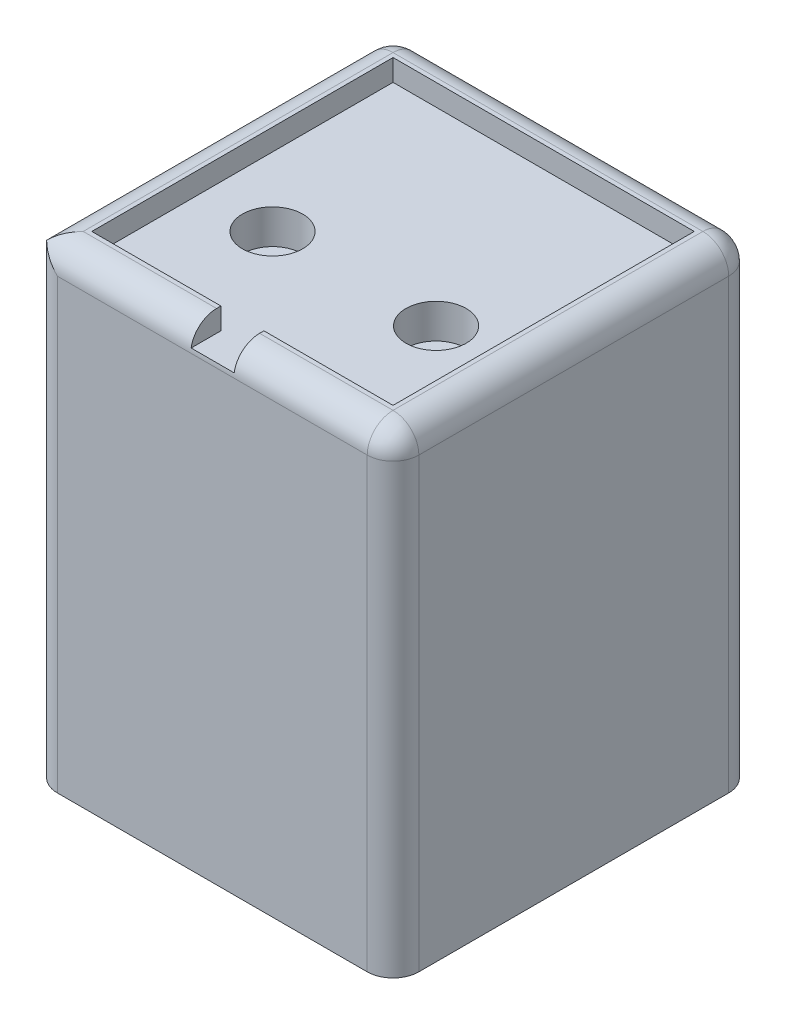
ISO-10303-21;
HEADER;
FILE_DESCRIPTION(('STEP AP214'),'2;1');
FILE_NAME('part.step','',(''),(''),'','','');
FILE_SCHEMA(('AUTOMOTIVE_DESIGN { 1 0 10303 214 1 1 1 1 }'));
ENDSEC;
DATA;
#1=APPLICATION_CONTEXT('core data for automotive mechanical design processes');
#2=APPLICATION_PROTOCOL_DEFINITION('international standard','automotive_design',2000,#1);
#3=PRODUCT_CONTEXT('',#1,'mechanical');
#4=PRODUCT('Part','Part','',(#3));
#5=PRODUCT_RELATED_PRODUCT_CATEGORY('part','',(#4));
#6=PRODUCT_DEFINITION_FORMATION('','',#4);
#7=PRODUCT_DEFINITION_CONTEXT('part definition',#1,'design');
#8=PRODUCT_DEFINITION('design','',#6,#7);
#9=PRODUCT_DEFINITION_SHAPE('','',#8);
#10=(LENGTH_UNIT() NAMED_UNIT(*) SI_UNIT(.MILLI.,.METRE.));
#11=(NAMED_UNIT(*) PLANE_ANGLE_UNIT() SI_UNIT($,.RADIAN.));
#12=(NAMED_UNIT(*) SI_UNIT($,.STERADIAN.) SOLID_ANGLE_UNIT());
#13=UNCERTAINTY_MEASURE_WITH_UNIT(LENGTH_MEASURE(1.E-05),#10,'distance_accuracy_value','');
#14=(GEOMETRIC_REPRESENTATION_CONTEXT(3) GLOBAL_UNCERTAINTY_ASSIGNED_CONTEXT((#13)) GLOBAL_UNIT_ASSIGNED_CONTEXT((#10,
#11,#12)) REPRESENTATION_CONTEXT('',''));
#15=CARTESIAN_POINT('',(0.,0.,0.));
#16=DIRECTION('',(0.,0.,1.));
#17=DIRECTION('',(1.,0.,0.));
#18=AXIS2_PLACEMENT_3D('',#15,#16,#17);
#19=CARTESIAN_POINT('',(17.5,52.5,17.5));
#20=DIRECTION('',(0.,0.,1.));
#21=DIRECTION('',(1.,0.,0.));
#22=AXIS2_PLACEMENT_3D('',#19,#20,#21);
#23=PLANE('',#22);
#24=DIRECTION('',(1.,0.,0.));
#25=VECTOR('',#24,1.);
#26=CARTESIAN_POINT('',(17.5,55.,17.5));
#27=LINE('',#26,#25);
#28=CARTESIAN_POINT('',(-17.5,55.,17.5));
#29=VERTEX_POINT('',#28);
#30=CARTESIAN_POINT('',(-2.5,55.,17.5));
#31=VERTEX_POINT('',#30);
#32=EDGE_CURVE('E195',#29,#31,#27,.T.);
#33=ORIENTED_EDGE('',*,*,#32,.T.);
#34=DIRECTION('',(0.,1.,0.));
#35=VECTOR('',#34,1.);
#36=CARTESIAN_POINT('',(-2.5,52.5,17.5));
#37=LINE('',#36,#35);
#38=CARTESIAN_POINT('',(-2.5,52.5,17.5));
#39=VERTEX_POINT('',#38);
#40=EDGE_CURVE('E177',#39,#31,#37,.T.);
#41=ORIENTED_EDGE('',*,*,#40,.F.);
#42=DIRECTION('',(1.,0.,0.));
#43=VECTOR('',#42,1.);
#44=CARTESIAN_POINT('',(17.5,52.5,17.5));
#45=LINE('',#44,#43);
#46=CARTESIAN_POINT('',(-17.5,52.5,17.5));
#47=VERTEX_POINT('',#46);
#48=EDGE_CURVE('E192',#47,#39,#45,.T.);
#49=ORIENTED_EDGE('',*,*,#48,.F.);
#50=DIRECTION('',(0.,1.,0.));
#51=VECTOR('',#50,1.);
#52=CARTESIAN_POINT('',(-17.5,52.5,17.5));
#53=LINE('',#52,#51);
#54=EDGE_CURVE('E218',#47,#29,#53,.T.);
#55=ORIENTED_EDGE('',*,*,#54,.T.);
#56=EDGE_LOOP('',(#33,#41,#49,#55));
#57=FACE_BOUND('',#56,.T.);
#58=ADVANCED_FACE('F49',(#57),#23,.F.);
#59=CARTESIAN_POINT('',(-21.,55.,-21.));
#60=DIRECTION('',(1.,0.,0.));
#61=DIRECTION('',(0.,0.,-1.));
#62=AXIS2_PLACEMENT_3D('',#59,#60,#61);
#63=PLANE('',#62);
#64=DIRECTION('',(0.,0.,1.));
#65=VECTOR('',#64,1.);
#66=CARTESIAN_POINT('',(-21.,0.,-21.));
#67=LINE('',#66,#65);
#68=CARTESIAN_POINT('',(-21.,0.,-18.));
#69=VERTEX_POINT('',#68);
#70=CARTESIAN_POINT('',(-21.,0.,18.));
#71=VERTEX_POINT('',#70);
#72=EDGE_CURVE('E235',#69,#71,#67,.T.);
#73=ORIENTED_EDGE('',*,*,#72,.T.);
#74=DIRECTION('',(0.,-1.,0.));
#75=VECTOR('',#74,1.);
#76=CARTESIAN_POINT('',(-21.,55.,18.));
#77=LINE('',#76,#75);
#78=CARTESIAN_POINT('',(-21.,52.,18.));
#79=VERTEX_POINT('',#78);
#80=EDGE_CURVE('E321',#71,#79,#77,.F.);
#81=ORIENTED_EDGE('',*,*,#80,.T.);
#82=DIRECTION('',(0.,0.,1.));
#83=VECTOR('',#82,1.);
#84=CARTESIAN_POINT('',(-21.,52.,-21.));
#85=LINE('',#84,#83);
#86=CARTESIAN_POINT('',(-21.,52.,-18.));
#87=VERTEX_POINT('',#86);
#88=EDGE_CURVE('E315',#79,#87,#85,.F.);
#89=ORIENTED_EDGE('',*,*,#88,.T.);
#90=DIRECTION('',(0.,-1.,0.));
#91=VECTOR('',#90,1.);
#92=CARTESIAN_POINT('',(-21.,55.,-18.));
#93=LINE('',#92,#91);
#94=EDGE_CURVE('E318',#87,#69,#93,.T.);
#95=ORIENTED_EDGE('',*,*,#94,.T.);
#96=EDGE_LOOP('',(#73,#81,#89,#95));
#97=FACE_BOUND('',#96,.T.);
#98=ADVANCED_FACE('F459',(#97),#63,.F.);
#99=CARTESIAN_POINT('',(21.,55.,21.));
#100=DIRECTION('',(0.,0.,-1.));
#101=DIRECTION('',(-1.,0.,0.));
#102=AXIS2_PLACEMENT_3D('',#99,#100,#101);
#103=PLANE('',#102);
#104=DIRECTION('',(1.,0.,0.));
#105=VECTOR('',#104,1.);
#106=CARTESIAN_POINT('',(21.,0.,21.));
#107=LINE('',#106,#105);
#108=CARTESIAN_POINT('',(-18.,0.,21.));
#109=VERTEX_POINT('',#108);
#110=CARTESIAN_POINT('',(18.,0.,21.));
#111=VERTEX_POINT('',#110);
#112=EDGE_CURVE('E248',#109,#111,#107,.T.);
#113=ORIENTED_EDGE('',*,*,#112,.T.);
#114=DIRECTION('',(0.,-1.,0.));
#115=VECTOR('',#114,1.);
#116=CARTESIAN_POINT('',(18.,55.,21.));
#117=LINE('',#116,#115);
#118=CARTESIAN_POINT('',(18.,52.,21.));
#119=VERTEX_POINT('',#118);
#120=EDGE_CURVE('E283',#111,#119,#117,.F.);
#121=ORIENTED_EDGE('',*,*,#120,.T.);
#122=DIRECTION('',(1.,0.,0.));
#123=VECTOR('',#122,1.);
#124=CARTESIAN_POINT('',(21.,52.,21.));
#125=LINE('',#124,#123);
#126=CARTESIAN_POINT('',(-18.,52.,21.));
#127=VERTEX_POINT('',#126);
#128=EDGE_CURVE('E279',#119,#127,#125,.F.);
#129=ORIENTED_EDGE('',*,*,#128,.T.);
#130=DIRECTION('',(0.,-1.,0.));
#131=VECTOR('',#130,1.);
#132=CARTESIAN_POINT('',(-18.,55.,21.));
#133=LINE('',#132,#131);
#134=EDGE_CURVE('E276',#127,#109,#133,.T.);
#135=ORIENTED_EDGE('',*,*,#134,.T.);
#136=EDGE_LOOP('',(#113,#121,#129,#135));
#137=FACE_BOUND('',#136,.T.);
#138=ADVANCED_FACE('F457',(#137),#103,.F.);
#139=CARTESIAN_POINT('',(21.,55.,-21.));
#140=DIRECTION('',(-1.,0.,0.));
#141=DIRECTION('',(0.,0.,1.));
#142=AXIS2_PLACEMENT_3D('',#139,#140,#141);
#143=PLANE('',#142);
#144=DIRECTION('',(0.,0.,-1.));
#145=VECTOR('',#144,1.);
#146=CARTESIAN_POINT('',(21.,52.,-21.));
#147=LINE('',#146,#145);
#148=CARTESIAN_POINT('',(21.,52.,-18.));
#149=VERTEX_POINT('',#148);
#150=CARTESIAN_POINT('',(21.,52.,18.));
#151=VERTEX_POINT('',#150);
#152=EDGE_CURVE('E294',#149,#151,#147,.F.);
#153=ORIENTED_EDGE('',*,*,#152,.T.);
#154=DIRECTION('',(0.,-1.,0.));
#155=VECTOR('',#154,1.);
#156=CARTESIAN_POINT('',(21.,55.,18.));
#157=LINE('',#156,#155);
#158=CARTESIAN_POINT('',(21.,0.,18.));
#159=VERTEX_POINT('',#158);
#160=EDGE_CURVE('E300',#151,#159,#157,.T.);
#161=ORIENTED_EDGE('',*,*,#160,.T.);
#162=DIRECTION('',(0.,0.,-1.));
#163=VECTOR('',#162,1.);
#164=CARTESIAN_POINT('',(21.,0.,-21.));
#165=LINE('',#164,#163);
#166=CARTESIAN_POINT('',(21.,0.,-18.));
#167=VERTEX_POINT('',#166);
#168=EDGE_CURVE('E252',#159,#167,#165,.T.);
#169=ORIENTED_EDGE('',*,*,#168,.T.);
#170=DIRECTION('',(0.,-1.,0.));
#171=VECTOR('',#170,1.);
#172=CARTESIAN_POINT('',(21.,55.,-18.));
#173=LINE('',#172,#171);
#174=EDGE_CURVE('E297',#167,#149,#173,.F.);
#175=ORIENTED_EDGE('',*,*,#174,.T.);
#176=EDGE_LOOP('',(#153,#161,#169,#175));
#177=FACE_BOUND('',#176,.T.);
#178=ADVANCED_FACE('F447',(#177),#143,.F.);
#179=CARTESIAN_POINT('',(21.,55.,-21.));
#180=DIRECTION('',(0.,0.,1.));
#181=DIRECTION('',(1.,0.,0.));
#182=AXIS2_PLACEMENT_3D('',#179,#180,#181);
#183=PLANE('',#182);
#184=DIRECTION('',(-1.,0.,0.));
#185=VECTOR('',#184,1.);
#186=CARTESIAN_POINT('',(21.,52.,-21.));
#187=LINE('',#186,#185);
#188=CARTESIAN_POINT('',(-18.,52.,-21.));
#189=VERTEX_POINT('',#188);
#190=CARTESIAN_POINT('',(18.,52.,-21.));
#191=VERTEX_POINT('',#190);
#192=EDGE_CURVE('E67',#189,#191,#187,.F.);
#193=ORIENTED_EDGE('',*,*,#192,.T.);
#194=DIRECTION('',(0.,-1.,0.));
#195=VECTOR('',#194,1.);
#196=CARTESIAN_POINT('',(18.,55.,-21.));
#197=LINE('',#196,#195);
#198=CARTESIAN_POINT('',(18.,0.,-21.));
#199=VERTEX_POINT('',#198);
#200=EDGE_CURVE('E12',#191,#199,#197,.T.);
#201=ORIENTED_EDGE('',*,*,#200,.T.);
#202=DIRECTION('',(-1.,0.,0.));
#203=VECTOR('',#202,1.);
#204=CARTESIAN_POINT('',(21.,0.,-21.));
#205=LINE('',#204,#203);
#206=CARTESIAN_POINT('',(-18.,0.,-21.));
#207=VERTEX_POINT('',#206);
#208=EDGE_CURVE('E256',#199,#207,#205,.T.);
#209=ORIENTED_EDGE('',*,*,#208,.T.);
#210=DIRECTION('',(0.,-1.,0.));
#211=VECTOR('',#210,1.);
#212=CARTESIAN_POINT('',(-18.,55.,-21.));
#213=LINE('',#212,#211);
#214=EDGE_CURVE('E60',#207,#189,#213,.F.);
#215=ORIENTED_EDGE('',*,*,#214,.T.);
#216=EDGE_LOOP('',(#193,#201,#209,#215));
#217=FACE_BOUND('',#216,.T.);
#218=ADVANCED_FACE('F465',(#217),#183,.F.);
#219=CARTESIAN_POINT('',(0.,55.,0.));
#220=DIRECTION('',(0.,-1.,0.));
#221=DIRECTION('',(0.,0.,-1.));
#222=AXIS2_PLACEMENT_3D('',#219,#220,#221);
#223=PLANE('',#222);
#224=DIRECTION('',(0.,0.,-1.));
#225=VECTOR('',#224,1.);
#226=CARTESIAN_POINT('',(2.50000000000001,55.,17.5));
#227=LINE('',#226,#225);
#228=CARTESIAN_POINT('',(2.50000000000001,55.,18.));
#229=VERTEX_POINT('',#228);
#230=CARTESIAN_POINT('',(2.50000000000001,55.,17.5));
#231=VERTEX_POINT('',#230);
#232=EDGE_CURVE('E186',#229,#231,#227,.T.);
#233=ORIENTED_EDGE('',*,*,#232,.F.);
#234=DIRECTION('',(1.,0.,0.));
#235=VECTOR('',#234,1.);
#236=CARTESIAN_POINT('',(0.,55.,18.));
#237=LINE('',#236,#235);
#238=CARTESIAN_POINT('',(18.,55.,18.));
#239=VERTEX_POINT('',#238);
#240=EDGE_CURVE('E272',#229,#239,#237,.T.);
#241=ORIENTED_EDGE('',*,*,#240,.T.);
#242=DIRECTION('',(0.,0.,-1.));
#243=VECTOR('',#242,1.);
#244=CARTESIAN_POINT('',(18.,55.,0.));
#245=LINE('',#244,#243);
#246=CARTESIAN_POINT('',(18.,55.,-18.));
#247=VERTEX_POINT('',#246);
#248=EDGE_CURVE('E260',#239,#247,#245,.T.);
#249=ORIENTED_EDGE('',*,*,#248,.T.);
#250=DIRECTION('',(-1.,0.,0.));
#251=VECTOR('',#250,1.);
#252=CARTESIAN_POINT('',(0.,55.,-18.));
#253=LINE('',#252,#251);
#254=CARTESIAN_POINT('',(-18.,55.,-18.));
#255=VERTEX_POINT('',#254);
#256=EDGE_CURVE('E263',#247,#255,#253,.T.);
#257=ORIENTED_EDGE('',*,*,#256,.T.);
#258=DIRECTION('',(0.,0.,1.));
#259=VECTOR('',#258,1.);
#260=CARTESIAN_POINT('',(-18.,55.,0.));
#261=LINE('',#260,#259);
#262=CARTESIAN_POINT('',(-18.,55.,18.));
#263=VERTEX_POINT('',#262);
#264=EDGE_CURVE('E266',#255,#263,#261,.T.);
#265=ORIENTED_EDGE('',*,*,#264,.T.);
#266=DIRECTION('',(1.,0.,0.));
#267=VECTOR('',#266,1.);
#268=CARTESIAN_POINT('',(-11.75,55.,18.));
#269=LINE('',#268,#267);
#270=CARTESIAN_POINT('',(-2.5,55.,18.));
#271=VERTEX_POINT('',#270);
#272=EDGE_CURVE('E269',#263,#271,#269,.T.);
#273=ORIENTED_EDGE('',*,*,#272,.T.);
#274=DIRECTION('',(0.,0.,1.));
#275=VECTOR('',#274,1.);
#276=CARTESIAN_POINT('',(-2.5,55.,17.5));
#277=LINE('',#276,#275);
#278=EDGE_CURVE('E374',#31,#271,#277,.T.);
#279=ORIENTED_EDGE('',*,*,#278,.F.);
#280=ORIENTED_EDGE('',*,*,#32,.F.);
#281=DIRECTION('',(0.,0.,1.));
#282=VECTOR('',#281,1.);
#283=CARTESIAN_POINT('',(-17.5,55.,-17.5));
#284=LINE('',#283,#282);
#285=CARTESIAN_POINT('',(-17.5,55.,-17.5));
#286=VERTEX_POINT('',#285);
#287=EDGE_CURVE('E197',#286,#29,#284,.T.);
#288=ORIENTED_EDGE('',*,*,#287,.F.);
#289=DIRECTION('',(-1.,0.,0.));
#290=VECTOR('',#289,1.);
#291=CARTESIAN_POINT('',(17.5,55.,-17.5));
#292=LINE('',#291,#290);
#293=CARTESIAN_POINT('',(17.5,55.,-17.5));
#294=VERTEX_POINT('',#293);
#295=EDGE_CURVE('E228',#294,#286,#292,.T.);
#296=ORIENTED_EDGE('',*,*,#295,.F.);
#297=DIRECTION('',(0.,0.,-1.));
#298=VECTOR('',#297,1.);
#299=CARTESIAN_POINT('',(17.5,55.,-17.5));
#300=LINE('',#299,#298);
#301=CARTESIAN_POINT('',(17.5,55.,17.5));
#302=VERTEX_POINT('',#301);
#303=EDGE_CURVE('E224',#302,#294,#300,.T.);
#304=ORIENTED_EDGE('',*,*,#303,.F.);
#305=EDGE_CURVE('E221',#231,#302,#27,.T.);
#306=ORIENTED_EDGE('',*,*,#305,.F.);
#307=EDGE_LOOP('',(#233,#241,#249,#257,#265,#273,#279,#280,#288,#296,#304,#306));
#308=FACE_BOUND('',#307,.T.);
#309=ADVANCED_FACE('F409',(#308),#223,.F.);
#310=CARTESIAN_POINT('',(0.,0.,0.));
#311=DIRECTION('',(0.,-1.,0.));
#312=DIRECTION('',(0.,0.,-1.));
#313=AXIS2_PLACEMENT_3D('',#310,#311,#312);
#314=PLANE('',#313);
#315=ORIENTED_EDGE('',*,*,#168,.F.);
#316=CARTESIAN_POINT('',(18.,0.,18.));
#317=DIRECTION('',(0.,-1.,0.));
#318=DIRECTION('',(0.,0.,-1.));
#319=AXIS2_PLACEMENT_3D('',#316,#317,#318);
#320=CIRCLE('',#319,3.);
#321=EDGE_CURVE('E312',#159,#111,#320,.T.);
#322=ORIENTED_EDGE('',*,*,#321,.T.);
#323=ORIENTED_EDGE('',*,*,#112,.F.);
#324=CARTESIAN_POINT('',(-18.,0.,18.));
#325=DIRECTION('',(0.,-1.,0.));
#326=DIRECTION('',(0.,0.,-1.));
#327=AXIS2_PLACEMENT_3D('',#324,#325,#326);
#328=CIRCLE('',#327,3.);
#329=EDGE_CURVE('E309',#109,#71,#328,.T.);
#330=ORIENTED_EDGE('',*,*,#329,.T.);
#331=ORIENTED_EDGE('',*,*,#72,.F.);
#332=CARTESIAN_POINT('',(-18.,0.,-18.));
#333=DIRECTION('',(0.,-1.,0.));
#334=DIRECTION('',(0.,0.,-1.));
#335=AXIS2_PLACEMENT_3D('',#332,#333,#334);
#336=CIRCLE('',#335,3.);
#337=EDGE_CURVE('E303',#69,#207,#336,.T.);
#338=ORIENTED_EDGE('',*,*,#337,.T.);
#339=ORIENTED_EDGE('',*,*,#208,.F.);
#340=CARTESIAN_POINT('',(18.,0.,-18.));
#341=DIRECTION('',(0.,-1.,0.));
#342=DIRECTION('',(0.,0.,-1.));
#343=AXIS2_PLACEMENT_3D('',#340,#341,#342);
#344=CIRCLE('',#343,3.);
#345=EDGE_CURVE('E306',#199,#167,#344,.T.);
#346=ORIENTED_EDGE('',*,*,#345,.T.);
#347=EDGE_LOOP('',(#315,#322,#323,#330,#331,#338,#339,#346));
#348=FACE_BOUND('',#347,.T.);
#349=ADVANCED_FACE('F456',(#348),#314,.T.);
#350=CARTESIAN_POINT('',(-17.5,52.5,-17.5));
#351=DIRECTION('',(-1.,0.,0.));
#352=DIRECTION('',(0.,0.,1.));
#353=AXIS2_PLACEMENT_3D('',#350,#351,#352);
#354=PLANE('',#353);
#355=ORIENTED_EDGE('',*,*,#287,.T.);
#356=ORIENTED_EDGE('',*,*,#54,.F.);
#357=DIRECTION('',(0.,0.,1.));
#358=VECTOR('',#357,1.);
#359=CARTESIAN_POINT('',(-17.5,52.5,-17.5));
#360=LINE('',#359,#358);
#361=CARTESIAN_POINT('',(-17.5,52.5,-17.5));
#362=VERTEX_POINT('',#361);
#363=EDGE_CURVE('E203',#362,#47,#360,.T.);
#364=ORIENTED_EDGE('',*,*,#363,.F.);
#365=DIRECTION('',(0.,1.,0.));
#366=VECTOR('',#365,1.);
#367=CARTESIAN_POINT('',(-17.5,52.5,-17.5));
#368=LINE('',#367,#366);
#369=EDGE_CURVE('E232',#362,#286,#368,.T.);
#370=ORIENTED_EDGE('',*,*,#369,.T.);
#371=EDGE_LOOP('',(#355,#356,#364,#370));
#372=FACE_BOUND('',#371,.T.);
#373=ADVANCED_FACE('F405',(#372),#354,.F.);
#374=CARTESIAN_POINT('',(17.5,52.5,-17.5));
#375=DIRECTION('',(0.,0.,-1.));
#376=DIRECTION('',(-1.,0.,0.));
#377=AXIS2_PLACEMENT_3D('',#374,#375,#376);
#378=PLANE('',#377);
#379=ORIENTED_EDGE('',*,*,#295,.T.);
#380=ORIENTED_EDGE('',*,*,#369,.F.);
#381=DIRECTION('',(-1.,0.,0.));
#382=VECTOR('',#381,1.);
#383=CARTESIAN_POINT('',(17.5,52.5,-17.5));
#384=LINE('',#383,#382);
#385=CARTESIAN_POINT('',(17.5,52.5,-17.5));
#386=VERTEX_POINT('',#385);
#387=EDGE_CURVE('E211',#386,#362,#384,.T.);
#388=ORIENTED_EDGE('',*,*,#387,.F.);
#389=DIRECTION('',(0.,1.,0.));
#390=VECTOR('',#389,1.);
#391=CARTESIAN_POINT('',(17.5,52.5,-17.5));
#392=LINE('',#391,#390);
#393=EDGE_CURVE('E236',#386,#294,#392,.T.);
#394=ORIENTED_EDGE('',*,*,#393,.T.);
#395=EDGE_LOOP('',(#379,#380,#388,#394));
#396=FACE_BOUND('',#395,.T.);
#397=ADVANCED_FACE('F401',(#396),#378,.F.);
#398=CARTESIAN_POINT('',(17.5,52.5,-17.5));
#399=DIRECTION('',(1.,0.,0.));
#400=DIRECTION('',(0.,0.,-1.));
#401=AXIS2_PLACEMENT_3D('',#398,#399,#400);
#402=PLANE('',#401);
#403=ORIENTED_EDGE('',*,*,#303,.T.);
#404=ORIENTED_EDGE('',*,*,#393,.F.);
#405=DIRECTION('',(0.,0.,-1.));
#406=VECTOR('',#405,1.);
#407=CARTESIAN_POINT('',(17.5,52.5,-17.5));
#408=LINE('',#407,#406);
#409=CARTESIAN_POINT('',(17.5,52.5,17.5));
#410=VERTEX_POINT('',#409);
#411=EDGE_CURVE('E205',#410,#386,#408,.T.);
#412=ORIENTED_EDGE('',*,*,#411,.F.);
#413=DIRECTION('',(0.,1.,0.));
#414=VECTOR('',#413,1.);
#415=CARTESIAN_POINT('',(17.5,52.5,17.5));
#416=LINE('',#415,#414);
#417=EDGE_CURVE('E239',#410,#302,#416,.T.);
#418=ORIENTED_EDGE('',*,*,#417,.T.);
#419=EDGE_LOOP('',(#403,#404,#412,#418));
#420=FACE_BOUND('',#419,.T.);
#421=ADVANCED_FACE('F398',(#420),#402,.F.);
#422=CARTESIAN_POINT('',(2.50000000000001,52.5,17.5));
#423=VERTEX_POINT('',#422);
#424=EDGE_CURVE('E206',#423,#410,#45,.T.);
#425=ORIENTED_EDGE('',*,*,#424,.F.);
#426=DIRECTION('',(0.,1.,0.));
#427=VECTOR('',#426,1.);
#428=CARTESIAN_POINT('',(2.50000000000001,52.5,17.5));
#429=LINE('',#428,#427);
#430=EDGE_CURVE('E198',#423,#231,#429,.T.);
#431=ORIENTED_EDGE('',*,*,#430,.T.);
#432=ORIENTED_EDGE('',*,*,#305,.T.);
#433=ORIENTED_EDGE('',*,*,#417,.F.);
#434=EDGE_LOOP('',(#425,#431,#432,#433));
#435=FACE_BOUND('',#434,.T.);
#436=ADVANCED_FACE('F394',(#435),#23,.F.);
#437=CARTESIAN_POINT('',(0.,52.5,0.));
#438=DIRECTION('',(0.,-1.,0.));
#439=DIRECTION('',(0.,0.,-1.));
#440=AXIS2_PLACEMENT_3D('',#437,#438,#439);
#441=PLANE('',#440);
#442=CARTESIAN_POINT('',(-9.5,52.5,4.5));
#443=DIRECTION('',(0.,1.,0.));
#444=DIRECTION('',(0.,0.,1.));
#445=AXIS2_PLACEMENT_3D('',#442,#443,#444);
#446=CIRCLE('',#445,3.5);
#447=CARTESIAN_POINT('',(-9.5,52.5,8.));
#448=VERTEX_POINT('',#447);
#449=EDGE_CURVE('E511',#448,#448,#446,.T.);
#450=ORIENTED_EDGE('',*,*,#449,.F.);
#451=EDGE_LOOP('',(#450));
#452=FACE_BOUND('',#451,.T.);
#453=CARTESIAN_POINT('',(9.50000000000001,52.5,4.5));
#454=DIRECTION('',(0.,1.,0.));
#455=DIRECTION('',(0.,0.,-1.));
#456=AXIS2_PLACEMENT_3D('',#453,#454,#455);
#457=CIRCLE('',#456,3.5);
#458=CARTESIAN_POINT('',(9.50000000000001,52.5,1.));
#459=VERTEX_POINT('',#458);
#460=EDGE_CURVE('E515',#459,#459,#457,.T.);
#461=ORIENTED_EDGE('',*,*,#460,.F.);
#462=EDGE_LOOP('',(#461));
#463=FACE_BOUND('',#462,.T.);
#464=DIRECTION('',(0.,0.,1.));
#465=VECTOR('',#464,1.);
#466=CARTESIAN_POINT('',(-2.5,52.5,17.5));
#467=LINE('',#466,#465);
#468=CARTESIAN_POINT('',(-2.49999999999999,52.5,20.9580398915498));
#469=VERTEX_POINT('',#468);
#470=EDGE_CURVE('E173',#39,#469,#467,.T.);
#471=ORIENTED_EDGE('',*,*,#470,.T.);
#472=DIRECTION('',(1.,0.,0.));
#473=VECTOR('',#472,1.);
#474=CARTESIAN_POINT('',(-2.49999999999999,52.5,20.9580398915498));
#475=LINE('',#474,#473);
#476=CARTESIAN_POINT('',(2.50000000000001,52.5,20.9580398915498));
#477=VERTEX_POINT('',#476);
#478=EDGE_CURVE('E288',#469,#477,#475,.T.);
#479=ORIENTED_EDGE('',*,*,#478,.T.);
#480=DIRECTION('',(0.,0.,-1.));
#481=VECTOR('',#480,1.);
#482=CARTESIAN_POINT('',(2.50000000000001,52.5,17.5));
#483=LINE('',#482,#481);
#484=EDGE_CURVE('E185',#477,#423,#483,.T.);
#485=ORIENTED_EDGE('',*,*,#484,.T.);
#486=ORIENTED_EDGE('',*,*,#424,.T.);
#487=ORIENTED_EDGE('',*,*,#411,.T.);
#488=ORIENTED_EDGE('',*,*,#387,.T.);
#489=ORIENTED_EDGE('',*,*,#363,.T.);
#490=ORIENTED_EDGE('',*,*,#48,.T.);
#491=EDGE_LOOP('',(#471,#479,#485,#486,#487,#488,#489,#490));
#492=FACE_BOUND('',#491,.T.);
#493=ADVANCED_FACE('F200',(#452,#463,#492),#441,.F.);
#494=CARTESIAN_POINT('',(-2.5,52.5,17.5));
#495=DIRECTION('',(-1.,0.,0.));
#496=DIRECTION('',(0.,0.,1.));
#497=AXIS2_PLACEMENT_3D('',#494,#495,#496);
#498=PLANE('',#497);
#499=ORIENTED_EDGE('',*,*,#278,.T.);
#500=CARTESIAN_POINT('',(-2.5,52.,18.));
#501=DIRECTION('',(-1.,0.,0.));
#502=DIRECTION('',(0.,0.,1.));
#503=AXIS2_PLACEMENT_3D('',#500,#501,#502);
#504=CIRCLE('',#503,3.);
#505=EDGE_CURVE('E180',#271,#469,#504,.F.);
#506=ORIENTED_EDGE('',*,*,#505,.T.);
#507=ORIENTED_EDGE('',*,*,#470,.F.);
#508=ORIENTED_EDGE('',*,*,#40,.T.);
#509=EDGE_LOOP('',(#499,#506,#507,#508));
#510=FACE_BOUND('',#509,.T.);
#511=ADVANCED_FACE('F176',(#510),#498,.F.);
#512=CARTESIAN_POINT('',(2.50000000000001,52.5,17.5));
#513=DIRECTION('',(1.,0.,0.));
#514=DIRECTION('',(0.,0.,-1.));
#515=AXIS2_PLACEMENT_3D('',#512,#513,#514);
#516=PLANE('',#515);
#517=ORIENTED_EDGE('',*,*,#484,.F.);
#518=CARTESIAN_POINT('',(2.50000000000001,52.,18.));
#519=DIRECTION('',(1.,0.,0.));
#520=DIRECTION('',(0.,0.,-1.));
#521=AXIS2_PLACEMENT_3D('',#518,#519,#520);
#522=CIRCLE('',#521,3.);
#523=EDGE_CURVE('E291',#477,#229,#522,.F.);
#524=ORIENTED_EDGE('',*,*,#523,.T.);
#525=ORIENTED_EDGE('',*,*,#232,.T.);
#526=ORIENTED_EDGE('',*,*,#430,.F.);
#527=EDGE_LOOP('',(#517,#524,#525,#526));
#528=FACE_BOUND('',#527,.T.);
#529=ADVANCED_FACE('F392',(#528),#516,.F.);
#530=CARTESIAN_POINT('',(18.,55.,-18.));
#531=DIRECTION('',(0.,-1.,0.));
#532=DIRECTION('',(0.,0.,-1.));
#533=AXIS2_PLACEMENT_3D('',#530,#531,#532);
#534=CYLINDRICAL_SURFACE('',#533,3.);
#535=ORIENTED_EDGE('',*,*,#345,.F.);
#536=ORIENTED_EDGE('',*,*,#200,.F.);
#537=CARTESIAN_POINT('',(18.,52.,-18.));
#538=DIRECTION('',(0.,1.,0.));
#539=DIRECTION('',(0.,0.,1.));
#540=AXIS2_PLACEMENT_3D('',#537,#538,#539);
#541=CIRCLE('',#540,3.);
#542=EDGE_CURVE('E366',#149,#191,#541,.T.);
#543=ORIENTED_EDGE('',*,*,#542,.F.);
#544=ORIENTED_EDGE('',*,*,#174,.F.);
#545=EDGE_LOOP('',(#535,#536,#543,#544));
#546=FACE_BOUND('',#545,.T.);
#547=ADVANCED_FACE('F51',(#546),#534,.T.);
#548=CARTESIAN_POINT('',(-18.,55.,-18.));
#549=DIRECTION('',(0.,-1.,0.));
#550=DIRECTION('',(0.,0.,-1.));
#551=AXIS2_PLACEMENT_3D('',#548,#549,#550);
#552=CYLINDRICAL_SURFACE('',#551,3.);
#553=ORIENTED_EDGE('',*,*,#337,.F.);
#554=ORIENTED_EDGE('',*,*,#94,.F.);
#555=CARTESIAN_POINT('',(-18.,52.,-18.));
#556=DIRECTION('',(0.,1.,0.));
#557=DIRECTION('',(0.,0.,1.));
#558=AXIS2_PLACEMENT_3D('',#555,#556,#557);
#559=CIRCLE('',#558,3.);
#560=EDGE_CURVE('E363',#189,#87,#559,.T.);
#561=ORIENTED_EDGE('',*,*,#560,.F.);
#562=ORIENTED_EDGE('',*,*,#214,.F.);
#563=EDGE_LOOP('',(#553,#554,#561,#562));
#564=FACE_BOUND('',#563,.T.);
#565=ADVANCED_FACE('F616',(#564),#552,.T.);
#566=CARTESIAN_POINT('',(0.,52.,-18.));
#567=DIRECTION('',(-1.,0.,0.));
#568=DIRECTION('',(0.,0.,1.));
#569=AXIS2_PLACEMENT_3D('',#566,#567,#568);
#570=CYLINDRICAL_SURFACE('',#569,3.);
#571=CARTESIAN_POINT('',(18.,52.,-18.));
#572=DIRECTION('',(1.,0.,0.));
#573=DIRECTION('',(0.,0.,-1.));
#574=AXIS2_PLACEMENT_3D('',#571,#572,#573);
#575=CIRCLE('',#574,3.);
#576=EDGE_CURVE('E53',#191,#247,#575,.T.);
#577=ORIENTED_EDGE('',*,*,#576,.F.);
#578=ORIENTED_EDGE('',*,*,#192,.F.);
#579=CARTESIAN_POINT('',(-18.,52.,-18.));
#580=DIRECTION('',(-1.,0.,0.));
#581=DIRECTION('',(0.,0.,1.));
#582=AXIS2_PLACEMENT_3D('',#579,#580,#581);
#583=CIRCLE('',#582,3.);
#584=EDGE_CURVE('E359',#255,#189,#583,.T.);
#585=ORIENTED_EDGE('',*,*,#584,.F.);
#586=ORIENTED_EDGE('',*,*,#256,.F.);
#587=EDGE_LOOP('',(#577,#578,#585,#586));
#588=FACE_BOUND('',#587,.T.);
#589=ADVANCED_FACE('F422',(#588),#570,.T.);
#590=CARTESIAN_POINT('',(18.,52.,-18.));
#591=DIRECTION('',(0.,0.,-1.));
#592=DIRECTION('',(-1.,0.,0.));
#593=AXIS2_PLACEMENT_3D('',#590,#591,#592);
#594=SPHERICAL_SURFACE('',#593,3.);
#595=ORIENTED_EDGE('',*,*,#542,.T.);
#596=ORIENTED_EDGE('',*,*,#576,.T.);
#597=CARTESIAN_POINT('',(18.,52.,-18.));
#598=DIRECTION('',(0.,0.,-1.));
#599=DIRECTION('',(-1.,0.,0.));
#600=AXIS2_PLACEMENT_3D('',#597,#598,#599);
#601=CIRCLE('',#600,3.);
#602=EDGE_CURVE('E355',#149,#247,#601,.F.);
#603=ORIENTED_EDGE('',*,*,#602,.F.);
#604=EDGE_LOOP('',(#595,#596,#603));
#605=FACE_BOUND('',#604,.T.);
#606=ADVANCED_FACE('F601',(#605),#594,.T.);
#607=CARTESIAN_POINT('',(-18.,52.,-18.));
#608=DIRECTION('',(0.,0.,-1.));
#609=DIRECTION('',(-1.,0.,0.));
#610=AXIS2_PLACEMENT_3D('',#607,#608,#609);
#611=SPHERICAL_SURFACE('',#610,3.);
#612=ORIENTED_EDGE('',*,*,#584,.T.);
#613=ORIENTED_EDGE('',*,*,#560,.T.);
#614=CARTESIAN_POINT('',(-18.,52.,-18.));
#615=DIRECTION('',(0.,0.,-1.));
#616=DIRECTION('',(-1.,0.,0.));
#617=AXIS2_PLACEMENT_3D('',#614,#615,#616);
#618=CIRCLE('',#617,3.);
#619=EDGE_CURVE('E347',#255,#87,#618,.F.);
#620=ORIENTED_EDGE('',*,*,#619,.F.);
#621=EDGE_LOOP('',(#612,#613,#620));
#622=FACE_BOUND('',#621,.T.);
#623=ADVANCED_FACE('F426',(#622),#611,.T.);
#624=CARTESIAN_POINT('',(18.,52.,0.));
#625=DIRECTION('',(0.,0.,-1.));
#626=DIRECTION('',(-1.,0.,0.));
#627=AXIS2_PLACEMENT_3D('',#624,#625,#626);
#628=CYLINDRICAL_SURFACE('',#627,3.);
#629=ORIENTED_EDGE('',*,*,#602,.T.);
#630=ORIENTED_EDGE('',*,*,#248,.F.);
#631=CARTESIAN_POINT('',(18.,52.,18.));
#632=DIRECTION('',(0.,0.,1.));
#633=DIRECTION('',(0.,-1.,0.));
#634=AXIS2_PLACEMENT_3D('',#631,#632,#633);
#635=CIRCLE('',#634,3.);
#636=EDGE_CURVE('E343',#151,#239,#635,.T.);
#637=ORIENTED_EDGE('',*,*,#636,.F.);
#638=ORIENTED_EDGE('',*,*,#152,.F.);
#639=EDGE_LOOP('',(#629,#630,#637,#638));
#640=FACE_BOUND('',#639,.T.);
#641=ADVANCED_FACE('F444',(#640),#628,.T.);
#642=CARTESIAN_POINT('',(18.,55.,18.));
#643=DIRECTION('',(0.,-1.,0.));
#644=DIRECTION('',(0.,0.,-1.));
#645=AXIS2_PLACEMENT_3D('',#642,#643,#644);
#646=CYLINDRICAL_SURFACE('',#645,3.);
#647=ORIENTED_EDGE('',*,*,#321,.F.);
#648=ORIENTED_EDGE('',*,*,#160,.F.);
#649=CARTESIAN_POINT('',(18.,52.,18.));
#650=DIRECTION('',(0.,1.,0.));
#651=DIRECTION('',(0.,0.,1.));
#652=AXIS2_PLACEMENT_3D('',#649,#650,#651);
#653=CIRCLE('',#652,3.);
#654=EDGE_CURVE('E339',#119,#151,#653,.T.);
#655=ORIENTED_EDGE('',*,*,#654,.F.);
#656=ORIENTED_EDGE('',*,*,#120,.F.);
#657=EDGE_LOOP('',(#647,#648,#655,#656));
#658=FACE_BOUND('',#657,.T.);
#659=ADVANCED_FACE('F452',(#658),#646,.T.);
#660=CARTESIAN_POINT('',(-18.,55.,18.));
#661=DIRECTION('',(0.,-1.,0.));
#662=DIRECTION('',(0.,0.,-1.));
#663=AXIS2_PLACEMENT_3D('',#660,#661,#662);
#664=CYLINDRICAL_SURFACE('',#663,3.);
#665=CARTESIAN_POINT('',(-18.,52.,18.));
#666=DIRECTION('',(0.,-0.707106781186547,0.707106781186547));
#667=DIRECTION('',(0.,0.707106781186547,0.707106781186547));
#668=AXIS2_PLACEMENT_3D('',#665,#666,#667);
#669=ELLIPSE('',#668,4.24264068711928,3.);
#670=CARTESIAN_POINT('',(-20.1213203435596,54.1213203435596,20.1213203435596));
#671=VERTEX_POINT('',#670);
#672=EDGE_CURVE('E351',#79,#671,#669,.F.);
#673=ORIENTED_EDGE('',*,*,#672,.F.);
#674=ORIENTED_EDGE('',*,*,#80,.F.);
#675=ORIENTED_EDGE('',*,*,#329,.F.);
#676=ORIENTED_EDGE('',*,*,#134,.F.);
#677=CARTESIAN_POINT('',(-18.,52.,18.));
#678=DIRECTION('',(0.707106781186547,0.707106781186547,0.));
#679=DIRECTION('',(0.707106781186547,-0.707106781186547,0.));
#680=AXIS2_PLACEMENT_3D('',#677,#678,#679);
#681=ELLIPSE('',#680,4.24264068711928,3.);
#682=EDGE_CURVE('E336',#671,#127,#681,.T.);
#683=ORIENTED_EDGE('',*,*,#682,.F.);
#684=EDGE_LOOP('',(#673,#674,#675,#676,#683));
#685=FACE_BOUND('',#684,.T.);
#686=ADVANCED_FACE('F435',(#685),#664,.T.);
#687=CARTESIAN_POINT('',(-18.,52.,0.));
#688=DIRECTION('',(0.,0.,1.));
#689=DIRECTION('',(1.,0.,0.));
#690=AXIS2_PLACEMENT_3D('',#687,#688,#689);
#691=CYLINDRICAL_SURFACE('',#690,3.);
#692=ORIENTED_EDGE('',*,*,#88,.F.);
#693=ORIENTED_EDGE('',*,*,#672,.T.);
#694=CARTESIAN_POINT('',(-18.,52.,18.));
#695=DIRECTION('',(0.707106781186548,0.,0.707106781186547));
#696=DIRECTION('',(0.707106781186547,0.,-0.707106781186548));
#697=AXIS2_PLACEMENT_3D('',#694,#695,#696);
#698=ELLIPSE('',#697,4.24264068711929,3.);
#699=EDGE_CURVE('E331',#263,#671,#698,.T.);
#700=ORIENTED_EDGE('',*,*,#699,.F.);
#701=ORIENTED_EDGE('',*,*,#264,.F.);
#702=ORIENTED_EDGE('',*,*,#619,.T.);
#703=EDGE_LOOP('',(#692,#693,#700,#701,#702));
#704=FACE_BOUND('',#703,.T.);
#705=ADVANCED_FACE('F429',(#704),#691,.T.);
#706=CARTESIAN_POINT('',(18.,52.,18.));
#707=DIRECTION('',(1.,0.,0.));
#708=DIRECTION('',(0.,0.,-1.));
#709=AXIS2_PLACEMENT_3D('',#706,#707,#708);
#710=SPHERICAL_SURFACE('',#709,3.);
#711=ORIENTED_EDGE('',*,*,#654,.T.);
#712=ORIENTED_EDGE('',*,*,#636,.T.);
#713=CARTESIAN_POINT('',(18.,52.,18.));
#714=DIRECTION('',(1.,0.,0.));
#715=DIRECTION('',(0.,0.,-1.));
#716=AXIS2_PLACEMENT_3D('',#713,#714,#715);
#717=CIRCLE('',#716,3.);
#718=EDGE_CURVE('E328',#119,#239,#717,.F.);
#719=ORIENTED_EDGE('',*,*,#718,.F.);
#720=EDGE_LOOP('',(#711,#712,#719));
#721=FACE_BOUND('',#720,.T.);
#722=ADVANCED_FACE('F441',(#721),#710,.T.);
#723=CARTESIAN_POINT('',(0.,52.,18.));
#724=DIRECTION('',(1.,0.,0.));
#725=DIRECTION('',(0.,0.,-1.));
#726=AXIS2_PLACEMENT_3D('',#723,#724,#725);
#727=CYLINDRICAL_SURFACE('',#726,3.);
#728=ORIENTED_EDGE('',*,*,#682,.T.);
#729=ORIENTED_EDGE('',*,*,#128,.F.);
#730=ORIENTED_EDGE('',*,*,#718,.T.);
#731=ORIENTED_EDGE('',*,*,#240,.F.);
#732=ORIENTED_EDGE('',*,*,#523,.F.);
#733=ORIENTED_EDGE('',*,*,#478,.F.);
#734=ORIENTED_EDGE('',*,*,#505,.F.);
#735=ORIENTED_EDGE('',*,*,#272,.F.);
#736=ORIENTED_EDGE('',*,*,#699,.T.);
#737=EDGE_LOOP('',(#728,#729,#730,#731,#732,#733,#734,#735,#736));
#738=FACE_BOUND('',#737,.T.);
#739=ADVANCED_FACE('F414',(#738),#727,.T.);
#740=CARTESIAN_POINT('',(9.50000000000001,48.5,4.5));
#741=DIRECTION('',(0.,1.,0.));
#742=DIRECTION('',(0.,0.,1.));
#743=AXIS2_PLACEMENT_3D('',#740,#741,#742);
#744=CYLINDRICAL_SURFACE('',#743,3.5);
#745=CARTESIAN_POINT('',(9.50000000000001,48.5,4.5));
#746=DIRECTION('',(0.,1.,0.));
#747=DIRECTION('',(0.,0.,-1.));
#748=AXIS2_PLACEMENT_3D('',#745,#746,#747);
#749=CIRCLE('',#748,3.5);
#750=CARTESIAN_POINT('',(9.50000000000001,48.5,1.));
#751=VERTEX_POINT('',#750);
#752=EDGE_CURVE('E521',#751,#751,#749,.T.);
#753=ORIENTED_EDGE('',*,*,#752,.F.);
#754=EDGE_LOOP('',(#753));
#755=FACE_BOUND('',#754,.T.);
#756=ORIENTED_EDGE('',*,*,#460,.T.);
#757=EDGE_LOOP('',(#756));
#758=FACE_BOUND('',#757,.T.);
#759=ADVANCED_FACE('F495',(#755,#758),#744,.F.);
#760=CARTESIAN_POINT('',(9.50000000000001,48.5,4.5));
#761=DIRECTION('',(0.,-1.,0.));
#762=DIRECTION('',(0.,0.,-1.));
#763=AXIS2_PLACEMENT_3D('',#760,#761,#762);
#764=PLANE('',#763);
#765=ORIENTED_EDGE('',*,*,#752,.T.);
#766=EDGE_LOOP('',(#765));
#767=FACE_BOUND('',#766,.T.);
#768=ADVANCED_FACE('F491',(#767),#764,.F.);
#769=CARTESIAN_POINT('',(-9.5,48.5,4.5));
#770=DIRECTION('',(0.,1.,0.));
#771=DIRECTION('',(0.,0.,1.));
#772=AXIS2_PLACEMENT_3D('',#769,#770,#771);
#773=CYLINDRICAL_SURFACE('',#772,3.5);
#774=CARTESIAN_POINT('',(-9.5,48.5,4.5));
#775=DIRECTION('',(0.,1.,0.));
#776=DIRECTION('',(0.,0.,1.));
#777=AXIS2_PLACEMENT_3D('',#774,#775,#776);
#778=CIRCLE('',#777,3.5);
#779=CARTESIAN_POINT('',(-9.5,48.5,8.));
#780=VERTEX_POINT('',#779);
#781=EDGE_CURVE('E332',#780,#780,#778,.T.);
#782=ORIENTED_EDGE('',*,*,#781,.F.);
#783=EDGE_LOOP('',(#782));
#784=FACE_BOUND('',#783,.T.);
#785=ORIENTED_EDGE('',*,*,#449,.T.);
#786=EDGE_LOOP('',(#785));
#787=FACE_BOUND('',#786,.T.);
#788=ADVANCED_FACE('F494',(#784,#787),#773,.F.);
#789=CARTESIAN_POINT('',(-9.5,48.5,4.5));
#790=DIRECTION('',(0.,1.,0.));
#791=DIRECTION('',(0.,0.,1.));
#792=AXIS2_PLACEMENT_3D('',#789,#790,#791);
#793=PLANE('',#792);
#794=ORIENTED_EDGE('',*,*,#781,.T.);
#795=EDGE_LOOP('',(#794));
#796=FACE_BOUND('',#795,.T.);
#797=ADVANCED_FACE('F502',(#796),#793,.T.);
#798=CLOSED_SHELL('',(#58,#98,#138,#178,#218,#309,#349,#373,#397,#421,#436,#493,#511,#529,#547,
#565,#589,#606,#623,#641,#659,#686,#705,#722,#739,#759,#768,#788,#797));
#799=MANIFOLD_SOLID_BREP('B2',#798);
#800=ADVANCED_BREP_SHAPE_REPRESENTATION('',(#18,#799),#14);
#801=SHAPE_DEFINITION_REPRESENTATION(#9,#800);
ENDSEC;
END-ISO-10303-21;
